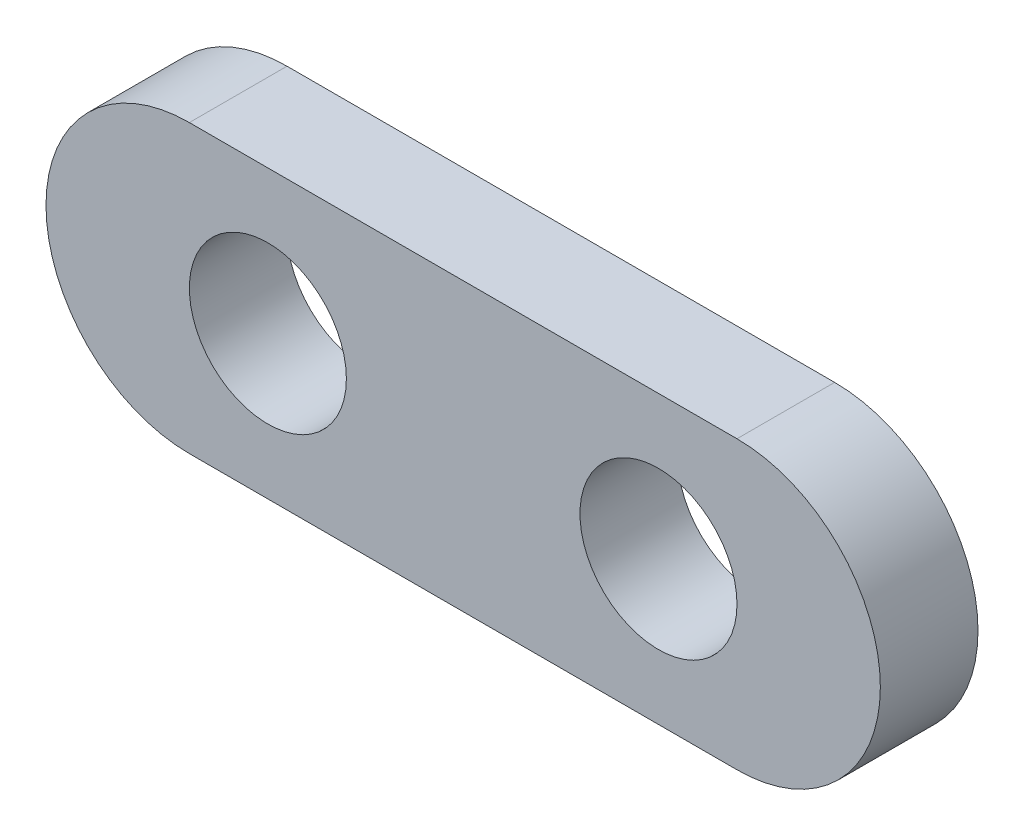
ISO-10303-21;
HEADER;
FILE_DESCRIPTION(('STEP AP214'),'2;1');
FILE_NAME('part.step','',(''),(''),'','','');
FILE_SCHEMA(('AUTOMOTIVE_DESIGN { 1 0 10303 214 1 1 1 1 }'));
ENDSEC;
DATA;
#1=APPLICATION_CONTEXT('core data for automotive mechanical design processes');
#2=APPLICATION_PROTOCOL_DEFINITION('international standard','automotive_design',2000,#1);
#3=PRODUCT_CONTEXT('',#1,'mechanical');
#4=PRODUCT('Part','Part','',(#3));
#5=PRODUCT_RELATED_PRODUCT_CATEGORY('part','',(#4));
#6=PRODUCT_DEFINITION_FORMATION('','',#4);
#7=PRODUCT_DEFINITION_CONTEXT('part definition',#1,'design');
#8=PRODUCT_DEFINITION('design','',#6,#7);
#9=PRODUCT_DEFINITION_SHAPE('','',#8);
#10=(LENGTH_UNIT() NAMED_UNIT(*) SI_UNIT(.MILLI.,.METRE.));
#11=(NAMED_UNIT(*) PLANE_ANGLE_UNIT() SI_UNIT($,.RADIAN.));
#12=(NAMED_UNIT(*) SI_UNIT($,.STERADIAN.) SOLID_ANGLE_UNIT());
#13=UNCERTAINTY_MEASURE_WITH_UNIT(LENGTH_MEASURE(1.E-05),#10,'distance_accuracy_value','');
#14=(GEOMETRIC_REPRESENTATION_CONTEXT(3) GLOBAL_UNCERTAINTY_ASSIGNED_CONTEXT((#13)) GLOBAL_UNIT_ASSIGNED_CONTEXT((#10,
#11,#12)) REPRESENTATION_CONTEXT('',''));
#15=CARTESIAN_POINT('',(0.,0.,0.));
#16=DIRECTION('',(0.,0.,1.));
#17=DIRECTION('',(1.,0.,0.));
#18=AXIS2_PLACEMENT_3D('',#15,#16,#17);
#19=CARTESIAN_POINT('',(8.90270000000005,0.,3.175));
#20=DIRECTION('',(0.,0.,1.));
#21=DIRECTION('',(1.,0.,0.));
#22=AXIS2_PLACEMENT_3D('',#19,#20,#21);
#23=PLANE('',#22);
#24=CARTESIAN_POINT('',(-6.34999999999997,0.,3.175));
#25=DIRECTION('',(0.,0.,1.));
#26=DIRECTION('',(1.,0.,0.));
#27=AXIS2_PLACEMENT_3D('',#24,#25,#26);
#28=CIRCLE('',#27,2.5527);
#29=CARTESIAN_POINT('',(-3.79729999999997,0.,3.175));
#30=VERTEX_POINT('',#29);
#31=EDGE_CURVE('E101',#30,#30,#28,.T.);
#32=ORIENTED_EDGE('',*,*,#31,.F.);
#33=EDGE_LOOP('',(#32));
#34=FACE_BOUND('',#33,.T.);
#35=CARTESIAN_POINT('',(8.90270000000005,0.,3.175));
#36=DIRECTION('',(0.,0.,1.));
#37=DIRECTION('',(1.,0.,0.));
#38=AXIS2_PLACEMENT_3D('',#35,#36,#37);
#39=CIRCLE('',#38,4.6609);
#40=CARTESIAN_POINT('',(8.90270000000005,-4.66089999999999,3.175));
#41=VERTEX_POINT('',#40);
#42=CARTESIAN_POINT('',(8.90270000000005,4.66090000000002,3.175));
#43=VERTEX_POINT('',#42);
#44=EDGE_CURVE('E86',#41,#43,#39,.T.);
#45=ORIENTED_EDGE('',*,*,#44,.T.);
#46=DIRECTION('',(-1.,0.,0.));
#47=VECTOR('',#46,1.);
#48=CARTESIAN_POINT('',(8.90270000000005,4.66090000000002,3.175));
#49=LINE('',#48,#47);
#50=CARTESIAN_POINT('',(-8.9027,4.66090000000001,3.175));
#51=VERTEX_POINT('',#50);
#52=EDGE_CURVE('E81',#43,#51,#49,.T.);
#53=ORIENTED_EDGE('',*,*,#52,.T.);
#54=CARTESIAN_POINT('',(-8.9027,0.,3.175));
#55=DIRECTION('',(0.,0.,1.));
#56=DIRECTION('',(1.,0.,0.));
#57=AXIS2_PLACEMENT_3D('',#54,#55,#56);
#58=CIRCLE('',#57,4.6609);
#59=CARTESIAN_POINT('',(-8.9027,-4.6609,3.175));
#60=VERTEX_POINT('',#59);
#61=EDGE_CURVE('E84',#51,#60,#58,.T.);
#62=ORIENTED_EDGE('',*,*,#61,.T.);
#63=DIRECTION('',(1.,0.,0.));
#64=VECTOR('',#63,1.);
#65=CARTESIAN_POINT('',(8.90270000000005,-4.66089999999999,3.175));
#66=LINE('',#65,#64);
#67=EDGE_CURVE('E51',#60,#41,#66,.T.);
#68=ORIENTED_EDGE('',*,*,#67,.T.);
#69=EDGE_LOOP('',(#45,#53,#62,#68));
#70=FACE_BOUND('',#69,.T.);
#71=CARTESIAN_POINT('',(6.35000000000003,0.,3.175));
#72=DIRECTION('',(0.,0.,1.));
#73=DIRECTION('',(1.,0.,0.));
#74=AXIS2_PLACEMENT_3D('',#71,#72,#73);
#75=CIRCLE('',#74,2.5527);
#76=CARTESIAN_POINT('',(8.90270000000003,0.,3.175));
#77=VERTEX_POINT('',#76);
#78=EDGE_CURVE('E116',#77,#77,#75,.T.);
#79=ORIENTED_EDGE('',*,*,#78,.F.);
#80=EDGE_LOOP('',(#79));
#81=FACE_BOUND('',#80,.T.);
#82=ADVANCED_FACE('F34',(#34,#70,#81),#23,.T.);
#83=CARTESIAN_POINT('',(8.90270000000005,0.,0.));
#84=DIRECTION('',(0.,0.,1.));
#85=DIRECTION('',(1.,0.,0.));
#86=AXIS2_PLACEMENT_3D('',#83,#84,#85);
#87=PLANE('',#86);
#88=CARTESIAN_POINT('',(8.90270000000005,0.,0.));
#89=DIRECTION('',(0.,0.,1.));
#90=DIRECTION('',(1.,0.,0.));
#91=AXIS2_PLACEMENT_3D('',#88,#89,#90);
#92=CIRCLE('',#91,4.6609);
#93=CARTESIAN_POINT('',(8.90270000000005,-4.66089999999999,0.));
#94=VERTEX_POINT('',#93);
#95=CARTESIAN_POINT('',(8.90270000000005,4.66090000000002,0.));
#96=VERTEX_POINT('',#95);
#97=EDGE_CURVE('E98',#94,#96,#92,.T.);
#98=ORIENTED_EDGE('',*,*,#97,.F.);
#99=DIRECTION('',(1.,0.,0.));
#100=VECTOR('',#99,1.);
#101=CARTESIAN_POINT('',(8.90270000000005,-4.66089999999999,0.));
#102=LINE('',#101,#100);
#103=CARTESIAN_POINT('',(-8.9027,-4.6609,0.));
#104=VERTEX_POINT('',#103);
#105=EDGE_CURVE('E74',#104,#94,#102,.T.);
#106=ORIENTED_EDGE('',*,*,#105,.F.);
#107=CARTESIAN_POINT('',(-8.9027,0.,0.));
#108=DIRECTION('',(0.,0.,1.));
#109=DIRECTION('',(1.,0.,0.));
#110=AXIS2_PLACEMENT_3D('',#107,#108,#109);
#111=CIRCLE('',#110,4.6609);
#112=CARTESIAN_POINT('',(-8.9027,4.66090000000001,0.));
#113=VERTEX_POINT('',#112);
#114=EDGE_CURVE('E68',#113,#104,#111,.T.);
#115=ORIENTED_EDGE('',*,*,#114,.F.);
#116=DIRECTION('',(-1.,0.,0.));
#117=VECTOR('',#116,1.);
#118=CARTESIAN_POINT('',(8.90270000000005,4.66090000000002,0.));
#119=LINE('',#118,#117);
#120=EDGE_CURVE('E90',#96,#113,#119,.T.);
#121=ORIENTED_EDGE('',*,*,#120,.F.);
#122=EDGE_LOOP('',(#98,#106,#115,#121));
#123=FACE_BOUND('',#122,.T.);
#124=CARTESIAN_POINT('',(-6.34999999999997,0.,0.));
#125=DIRECTION('',(0.,0.,1.));
#126=DIRECTION('',(1.,0.,0.));
#127=AXIS2_PLACEMENT_3D('',#124,#125,#126);
#128=CIRCLE('',#127,2.5527);
#129=CARTESIAN_POINT('',(-3.79729999999997,0.,0.));
#130=VERTEX_POINT('',#129);
#131=EDGE_CURVE('E113',#130,#130,#128,.T.);
#132=ORIENTED_EDGE('',*,*,#131,.T.);
#133=EDGE_LOOP('',(#132));
#134=FACE_BOUND('',#133,.T.);
#135=CARTESIAN_POINT('',(6.35000000000003,0.,0.));
#136=DIRECTION('',(0.,0.,1.));
#137=DIRECTION('',(1.,0.,0.));
#138=AXIS2_PLACEMENT_3D('',#135,#136,#137);
#139=CIRCLE('',#138,2.5527);
#140=CARTESIAN_POINT('',(8.90270000000003,0.,0.));
#141=VERTEX_POINT('',#140);
#142=EDGE_CURVE('E119',#141,#141,#139,.T.);
#143=ORIENTED_EDGE('',*,*,#142,.T.);
#144=EDGE_LOOP('',(#143));
#145=FACE_BOUND('',#144,.T.);
#146=ADVANCED_FACE('F109',(#123,#134,#145),#87,.F.);
#147=CARTESIAN_POINT('',(8.90270000000005,0.,3.175));
#148=DIRECTION('',(0.,0.,-1.));
#149=DIRECTION('',(-1.,0.,0.));
#150=AXIS2_PLACEMENT_3D('',#147,#148,#149);
#151=CYLINDRICAL_SURFACE('',#150,4.6609);
#152=ORIENTED_EDGE('',*,*,#97,.T.);
#153=DIRECTION('',(0.,0.,-1.));
#154=VECTOR('',#153,1.);
#155=CARTESIAN_POINT('',(8.90270000000005,4.66090000000002,3.175));
#156=LINE('',#155,#154);
#157=EDGE_CURVE('E11',#43,#96,#156,.T.);
#158=ORIENTED_EDGE('',*,*,#157,.F.);
#159=ORIENTED_EDGE('',*,*,#44,.F.);
#160=DIRECTION('',(0.,0.,-1.));
#161=VECTOR('',#160,1.);
#162=CARTESIAN_POINT('',(8.90270000000005,-4.66089999999999,3.175));
#163=LINE('',#162,#161);
#164=EDGE_CURVE('E94',#41,#94,#163,.T.);
#165=ORIENTED_EDGE('',*,*,#164,.T.);
#166=EDGE_LOOP('',(#152,#158,#159,#165));
#167=FACE_BOUND('',#166,.T.);
#168=ADVANCED_FACE('F36',(#167),#151,.T.);
#169=CARTESIAN_POINT('',(8.90270000000005,4.66090000000002,3.175));
#170=DIRECTION('',(0.,-1.,0.));
#171=DIRECTION('',(1.,0.,0.));
#172=AXIS2_PLACEMENT_3D('',#169,#170,#171);
#173=PLANE('',#172);
#174=ORIENTED_EDGE('',*,*,#120,.T.);
#175=DIRECTION('',(0.,0.,-1.));
#176=VECTOR('',#175,1.);
#177=CARTESIAN_POINT('',(-8.9027,4.66090000000001,3.175));
#178=LINE('',#177,#176);
#179=EDGE_CURVE('E43',#51,#113,#178,.T.);
#180=ORIENTED_EDGE('',*,*,#179,.F.);
#181=ORIENTED_EDGE('',*,*,#52,.F.);
#182=ORIENTED_EDGE('',*,*,#157,.T.);
#183=EDGE_LOOP('',(#174,#180,#181,#182));
#184=FACE_BOUND('',#183,.T.);
#185=ADVANCED_FACE('F89',(#184),#173,.F.);
#186=CARTESIAN_POINT('',(-8.9027,0.,3.175));
#187=DIRECTION('',(0.,0.,-1.));
#188=DIRECTION('',(-1.,0.,0.));
#189=AXIS2_PLACEMENT_3D('',#186,#187,#188);
#190=CYLINDRICAL_SURFACE('',#189,4.6609);
#191=ORIENTED_EDGE('',*,*,#114,.T.);
#192=DIRECTION('',(0.,0.,-1.));
#193=VECTOR('',#192,1.);
#194=CARTESIAN_POINT('',(-8.9027,-4.6609,3.175));
#195=LINE('',#194,#193);
#196=EDGE_CURVE('E91',#60,#104,#195,.T.);
#197=ORIENTED_EDGE('',*,*,#196,.F.);
#198=ORIENTED_EDGE('',*,*,#61,.F.);
#199=ORIENTED_EDGE('',*,*,#179,.T.);
#200=EDGE_LOOP('',(#191,#197,#198,#199));
#201=FACE_BOUND('',#200,.T.);
#202=ADVANCED_FACE('F92',(#201),#190,.T.);
#203=CARTESIAN_POINT('',(8.90270000000005,-4.66089999999999,3.175));
#204=DIRECTION('',(0.,1.,0.));
#205=DIRECTION('',(-1.,0.,0.));
#206=AXIS2_PLACEMENT_3D('',#203,#204,#205);
#207=PLANE('',#206);
#208=ORIENTED_EDGE('',*,*,#105,.T.);
#209=ORIENTED_EDGE('',*,*,#164,.F.);
#210=ORIENTED_EDGE('',*,*,#67,.F.);
#211=ORIENTED_EDGE('',*,*,#196,.T.);
#212=EDGE_LOOP('',(#208,#209,#210,#211));
#213=FACE_BOUND('',#212,.T.);
#214=ADVANCED_FACE('F106',(#213),#207,.F.);
#215=CARTESIAN_POINT('',(-6.34999999999997,0.,3.175));
#216=DIRECTION('',(0.,0.,-1.));
#217=DIRECTION('',(-1.,0.,0.));
#218=AXIS2_PLACEMENT_3D('',#215,#216,#217);
#219=CYLINDRICAL_SURFACE('',#218,2.5527);
#220=ORIENTED_EDGE('',*,*,#31,.T.);
#221=EDGE_LOOP('',(#220));
#222=FACE_BOUND('',#221,.T.);
#223=ORIENTED_EDGE('',*,*,#131,.F.);
#224=EDGE_LOOP('',(#223));
#225=FACE_BOUND('',#224,.T.);
#226=ADVANCED_FACE('F136',(#222,#225),#219,.F.);
#227=CARTESIAN_POINT('',(6.35000000000003,0.,3.175));
#228=DIRECTION('',(0.,0.,-1.));
#229=DIRECTION('',(-1.,0.,0.));
#230=AXIS2_PLACEMENT_3D('',#227,#228,#229);
#231=CYLINDRICAL_SURFACE('',#230,2.5527);
#232=ORIENTED_EDGE('',*,*,#78,.T.);
#233=EDGE_LOOP('',(#232));
#234=FACE_BOUND('',#233,.T.);
#235=ORIENTED_EDGE('',*,*,#142,.F.);
#236=EDGE_LOOP('',(#235));
#237=FACE_BOUND('',#236,.T.);
#238=ADVANCED_FACE('F125',(#234,#237),#231,.F.);
#239=CLOSED_SHELL('',(#82,#146,#168,#185,#202,#214,#226,#238));
#240=MANIFOLD_SOLID_BREP('B2',#239);
#241=ADVANCED_BREP_SHAPE_REPRESENTATION('',(#18,#240),#14);
#242=SHAPE_DEFINITION_REPRESENTATION(#9,#241);
ENDSEC;
END-ISO-10303-21;
